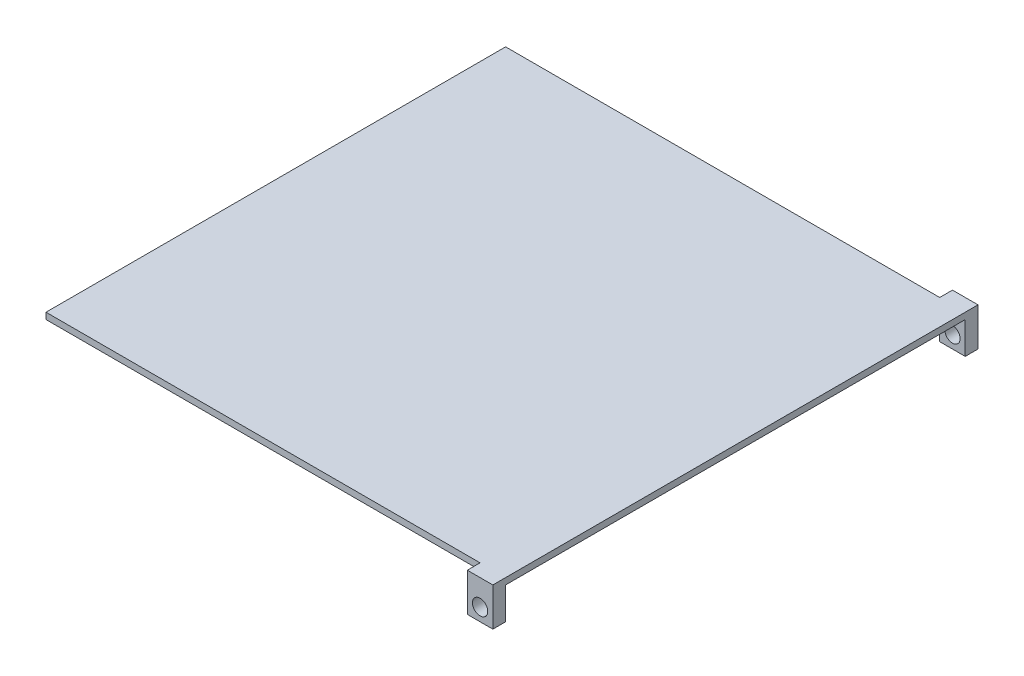
ISO-10303-21;
HEADER;
FILE_DESCRIPTION(('STEP AP214'),'2;1');
FILE_NAME('part.step','',(''),(''),'','','');
FILE_SCHEMA(('AUTOMOTIVE_DESIGN { 1 0 10303 214 1 1 1 1 }'));
ENDSEC;
DATA;
#1=APPLICATION_CONTEXT('core data for automotive mechanical design processes');
#2=APPLICATION_PROTOCOL_DEFINITION('international standard','automotive_design',2000,#1);
#3=PRODUCT_CONTEXT('',#1,'mechanical');
#4=PRODUCT('Part','Part','',(#3));
#5=PRODUCT_RELATED_PRODUCT_CATEGORY('part','',(#4));
#6=PRODUCT_DEFINITION_FORMATION('','',#4);
#7=PRODUCT_DEFINITION_CONTEXT('part definition',#1,'design');
#8=PRODUCT_DEFINITION('design','',#6,#7);
#9=PRODUCT_DEFINITION_SHAPE('','',#8);
#10=(LENGTH_UNIT() NAMED_UNIT(*) SI_UNIT(.MILLI.,.METRE.));
#11=(NAMED_UNIT(*) PLANE_ANGLE_UNIT() SI_UNIT($,.RADIAN.));
#12=(NAMED_UNIT(*) SI_UNIT($,.STERADIAN.) SOLID_ANGLE_UNIT());
#13=UNCERTAINTY_MEASURE_WITH_UNIT(LENGTH_MEASURE(1.E-05),#10,'distance_accuracy_value','');
#14=(GEOMETRIC_REPRESENTATION_CONTEXT(3) GLOBAL_UNCERTAINTY_ASSIGNED_CONTEXT((#13)) GLOBAL_UNIT_ASSIGNED_CONTEXT((#10,
#11,#12)) REPRESENTATION_CONTEXT('',''));
#15=CARTESIAN_POINT('',(0.,0.,0.));
#16=DIRECTION('',(0.,0.,1.));
#17=DIRECTION('',(1.,0.,0.));
#18=AXIS2_PLACEMENT_3D('',#15,#16,#17);
#19=CARTESIAN_POINT('',(0.,6.35,-457.2));
#20=DIRECTION('',(0.,0.,-1.));
#21=DIRECTION('',(-1.,0.,0.));
#22=AXIS2_PLACEMENT_3D('',#19,#20,#21);
#23=PLANE('',#22);
#24=DIRECTION('',(1.,0.,0.));
#25=VECTOR('',#24,1.);
#26=CARTESIAN_POINT('',(0.,6.35,-457.2));
#27=LINE('',#26,#25);
#28=CARTESIAN_POINT('',(0.,6.35,-457.2));
#29=VERTEX_POINT('',#28);
#30=CARTESIAN_POINT('',(431.8,6.35,-457.2));
#31=VERTEX_POINT('',#30);
#32=EDGE_CURVE('E157',#29,#31,#27,.T.);
#33=ORIENTED_EDGE('',*,*,#32,.T.);
#34=DIRECTION('',(0.,-1.,0.));
#35=VECTOR('',#34,1.);
#36=CARTESIAN_POINT('',(431.8,6.35,-457.2));
#37=LINE('',#36,#35);
#38=CARTESIAN_POINT('',(431.8,0.,-457.2));
#39=VERTEX_POINT('',#38);
#40=EDGE_CURVE('E139',#31,#39,#37,.T.);
#41=ORIENTED_EDGE('',*,*,#40,.T.);
#42=DIRECTION('',(1.,0.,0.));
#43=VECTOR('',#42,1.);
#44=CARTESIAN_POINT('',(0.,0.,-457.2));
#45=LINE('',#44,#43);
#46=CARTESIAN_POINT('',(0.,0.,-457.2));
#47=VERTEX_POINT('',#46);
#48=EDGE_CURVE('E161',#47,#39,#45,.T.);
#49=ORIENTED_EDGE('',*,*,#48,.F.);
#50=DIRECTION('',(0.,-1.,0.));
#51=VECTOR('',#50,1.);
#52=CARTESIAN_POINT('',(0.,6.35,-457.2));
#53=LINE('',#52,#51);
#54=EDGE_CURVE('E160',#29,#47,#53,.T.);
#55=ORIENTED_EDGE('',*,*,#54,.F.);
#56=EDGE_LOOP('',(#33,#41,#49,#55));
#57=FACE_BOUND('',#56,.T.);
#58=ADVANCED_FACE('F33',(#57),#23,.T.);
#59=CARTESIAN_POINT('',(0.,6.35,0.));
#60=DIRECTION('',(0.,0.,-1.));
#61=DIRECTION('',(-1.,0.,0.));
#62=AXIS2_PLACEMENT_3D('',#59,#60,#61);
#63=PLANE('',#62);
#64=DIRECTION('',(0.,-1.,0.));
#65=VECTOR('',#64,1.);
#66=CARTESIAN_POINT('',(431.8,6.35,0.));
#67=LINE('',#66,#65);
#68=CARTESIAN_POINT('',(431.8,6.35,0.));
#69=VERTEX_POINT('',#68);
#70=CARTESIAN_POINT('',(431.8,0.,0.));
#71=VERTEX_POINT('',#70);
#72=EDGE_CURVE('E56',#69,#71,#67,.T.);
#73=ORIENTED_EDGE('',*,*,#72,.F.);
#74=DIRECTION('',(1.,0.,0.));
#75=VECTOR('',#74,1.);
#76=CARTESIAN_POINT('',(0.,6.35,0.));
#77=LINE('',#76,#75);
#78=CARTESIAN_POINT('',(0.,6.35,0.));
#79=VERTEX_POINT('',#78);
#80=EDGE_CURVE('E201',#79,#69,#77,.T.);
#81=ORIENTED_EDGE('',*,*,#80,.F.);
#82=DIRECTION('',(0.,-1.,0.));
#83=VECTOR('',#82,1.);
#84=CARTESIAN_POINT('',(0.,6.35,0.));
#85=LINE('',#84,#83);
#86=CARTESIAN_POINT('',(0.,0.,0.));
#87=VERTEX_POINT('',#86);
#88=EDGE_CURVE('E11',#79,#87,#85,.T.);
#89=ORIENTED_EDGE('',*,*,#88,.T.);
#90=DIRECTION('',(1.,0.,0.));
#91=VECTOR('',#90,1.);
#92=CARTESIAN_POINT('',(0.,0.,0.));
#93=LINE('',#92,#91);
#94=EDGE_CURVE('E208',#87,#71,#93,.T.);
#95=ORIENTED_EDGE('',*,*,#94,.T.);
#96=EDGE_LOOP('',(#73,#81,#89,#95));
#97=FACE_BOUND('',#96,.T.);
#98=ADVANCED_FACE('F230',(#97),#63,.F.);
#99=CARTESIAN_POINT('',(0.,6.35,0.));
#100=DIRECTION('',(1.,0.,0.));
#101=DIRECTION('',(0.,0.,-1.));
#102=AXIS2_PLACEMENT_3D('',#99,#100,#101);
#103=PLANE('',#102);
#104=DIRECTION('',(0.,0.,1.));
#105=VECTOR('',#104,1.);
#106=CARTESIAN_POINT('',(0.,0.,0.));
#107=LINE('',#106,#105);
#108=EDGE_CURVE('E197',#47,#87,#107,.T.);
#109=ORIENTED_EDGE('',*,*,#108,.T.);
#110=ORIENTED_EDGE('',*,*,#88,.F.);
#111=DIRECTION('',(0.,0.,1.));
#112=VECTOR('',#111,1.);
#113=CARTESIAN_POINT('',(0.,6.35,0.));
#114=LINE('',#113,#112);
#115=EDGE_CURVE('E198',#29,#79,#114,.T.);
#116=ORIENTED_EDGE('',*,*,#115,.F.);
#117=ORIENTED_EDGE('',*,*,#54,.T.);
#118=EDGE_LOOP('',(#109,#110,#116,#117));
#119=FACE_BOUND('',#118,.T.);
#120=ADVANCED_FACE('F35',(#119),#103,.F.);
#121=CARTESIAN_POINT('',(457.2,6.35,0.));
#122=DIRECTION('',(-1.,0.,0.));
#123=DIRECTION('',(0.,0.,1.));
#124=AXIS2_PLACEMENT_3D('',#121,#122,#123);
#125=PLANE('',#124);
#126=DIRECTION('',(0.,0.,-1.));
#127=VECTOR('',#126,1.);
#128=CARTESIAN_POINT('',(457.2,0.,0.));
#129=LINE('',#128,#127);
#130=CARTESIAN_POINT('',(457.2,0.,0.));
#131=VERTEX_POINT('',#130);
#132=CARTESIAN_POINT('',(457.2,0.,-457.2));
#133=VERTEX_POINT('',#132);
#134=EDGE_CURVE('E202',#131,#133,#129,.T.);
#135=ORIENTED_EDGE('',*,*,#134,.T.);
#136=DIRECTION('',(0.,1.,0.));
#137=VECTOR('',#136,1.);
#138=CARTESIAN_POINT('',(457.2,6.35,-457.2));
#139=LINE('',#138,#137);
#140=CARTESIAN_POINT('',(457.2,-31.75,-457.2));
#141=VERTEX_POINT('',#140);
#142=EDGE_CURVE('E123',#141,#133,#139,.T.);
#143=ORIENTED_EDGE('',*,*,#142,.F.);
#144=DIRECTION('',(0.,0.,1.));
#145=VECTOR('',#144,1.);
#146=CARTESIAN_POINT('',(457.2,-31.75,-469.9));
#147=LINE('',#146,#145);
#148=CARTESIAN_POINT('',(457.2,-31.75,-469.9));
#149=VERTEX_POINT('',#148);
#150=EDGE_CURVE('E117',#149,#141,#147,.T.);
#151=ORIENTED_EDGE('',*,*,#150,.F.);
#152=DIRECTION('',(0.,1.,0.));
#153=VECTOR('',#152,1.);
#154=CARTESIAN_POINT('',(457.2,6.35,-469.9));
#155=LINE('',#154,#153);
#156=CARTESIAN_POINT('',(457.2,6.35,-469.9));
#157=VERTEX_POINT('',#156);
#158=EDGE_CURVE('E121',#149,#157,#155,.T.);
#159=ORIENTED_EDGE('',*,*,#158,.T.);
#160=DIRECTION('',(0.,0.,-1.));
#161=VECTOR('',#160,1.);
#162=CARTESIAN_POINT('',(457.2,6.35,0.));
#163=LINE('',#162,#161);
#164=CARTESIAN_POINT('',(457.2,6.35,12.7));
#165=VERTEX_POINT('',#164);
#166=EDGE_CURVE('E41',#165,#157,#163,.T.);
#167=ORIENTED_EDGE('',*,*,#166,.F.);
#168=DIRECTION('',(0.,1.,0.));
#169=VECTOR('',#168,1.);
#170=CARTESIAN_POINT('',(457.2,6.35,12.7));
#171=LINE('',#170,#169);
#172=CARTESIAN_POINT('',(457.2,-31.75,12.7));
#173=VERTEX_POINT('',#172);
#174=EDGE_CURVE('E173',#173,#165,#171,.T.);
#175=ORIENTED_EDGE('',*,*,#174,.F.);
#176=DIRECTION('',(0.,0.,-1.));
#177=VECTOR('',#176,1.);
#178=CARTESIAN_POINT('',(457.2,-31.75,12.7));
#179=LINE('',#178,#177);
#180=CARTESIAN_POINT('',(457.2,-31.75,0.));
#181=VERTEX_POINT('',#180);
#182=EDGE_CURVE('E183',#173,#181,#179,.T.);
#183=ORIENTED_EDGE('',*,*,#182,.T.);
#184=DIRECTION('',(0.,1.,0.));
#185=VECTOR('',#184,1.);
#186=CARTESIAN_POINT('',(457.2,6.35,0.));
#187=LINE('',#186,#185);
#188=EDGE_CURVE('E170',#181,#131,#187,.T.);
#189=ORIENTED_EDGE('',*,*,#188,.T.);
#190=EDGE_LOOP('',(#135,#143,#151,#159,#167,#175,#183,#189));
#191=FACE_BOUND('',#190,.T.);
#192=ADVANCED_FACE('F120',(#191),#125,.F.);
#193=CARTESIAN_POINT('',(0.,6.35,0.));
#194=DIRECTION('',(0.,-1.,0.));
#195=DIRECTION('',(0.,0.,-1.));
#196=AXIS2_PLACEMENT_3D('',#193,#194,#195);
#197=PLANE('',#196);
#198=ORIENTED_EDGE('',*,*,#115,.T.);
#199=ORIENTED_EDGE('',*,*,#80,.T.);
#200=DIRECTION('',(0.,0.,-1.));
#201=VECTOR('',#200,1.);
#202=CARTESIAN_POINT('',(431.8,6.35,12.7));
#203=LINE('',#202,#201);
#204=CARTESIAN_POINT('',(431.8,6.35,12.7));
#205=VERTEX_POINT('',#204);
#206=EDGE_CURVE('E194',#205,#69,#203,.T.);
#207=ORIENTED_EDGE('',*,*,#206,.F.);
#208=DIRECTION('',(-1.,0.,0.));
#209=VECTOR('',#208,1.);
#210=CARTESIAN_POINT('',(457.2,6.35,12.7));
#211=LINE('',#210,#209);
#212=EDGE_CURVE('E176',#165,#205,#211,.T.);
#213=ORIENTED_EDGE('',*,*,#212,.F.);
#214=ORIENTED_EDGE('',*,*,#166,.T.);
#215=DIRECTION('',(-1.,0.,0.));
#216=VECTOR('',#215,1.);
#217=CARTESIAN_POINT('',(457.2,6.35,-469.9));
#218=LINE('',#217,#216);
#219=CARTESIAN_POINT('',(431.8,6.35,-469.9));
#220=VERTEX_POINT('',#219);
#221=EDGE_CURVE('E138',#157,#220,#218,.T.);
#222=ORIENTED_EDGE('',*,*,#221,.T.);
#223=DIRECTION('',(0.,0.,1.));
#224=VECTOR('',#223,1.);
#225=CARTESIAN_POINT('',(431.8,6.35,-469.9));
#226=LINE('',#225,#224);
#227=EDGE_CURVE('E148',#220,#31,#226,.T.);
#228=ORIENTED_EDGE('',*,*,#227,.T.);
#229=ORIENTED_EDGE('',*,*,#32,.F.);
#230=EDGE_LOOP('',(#198,#199,#207,#213,#214,#222,#228,#229));
#231=FACE_BOUND('',#230,.T.);
#232=ADVANCED_FACE('F227',(#231),#197,.F.);
#233=CARTESIAN_POINT('',(0.,0.,0.));
#234=DIRECTION('',(0.,-1.,0.));
#235=DIRECTION('',(0.,0.,-1.));
#236=AXIS2_PLACEMENT_3D('',#233,#234,#235);
#237=PLANE('',#236);
#238=CARTESIAN_POINT('',(228.6,0.,-228.6));
#239=DIRECTION('',(0.,-1.,0.));
#240=DIRECTION('',(0.,0.,-1.));
#241=AXIS2_PLACEMENT_3D('',#238,#239,#240);
#242=CIRCLE('',#241,3.175);
#243=CARTESIAN_POINT('',(228.6,0.,-231.775));
#244=VERTEX_POINT('',#243);
#245=EDGE_CURVE('E394',#244,#244,#242,.T.);
#246=ORIENTED_EDGE('',*,*,#245,.F.);
#247=EDGE_LOOP('',(#246));
#248=FACE_BOUND('',#247,.T.);
#249=ORIENTED_EDGE('',*,*,#108,.F.);
#250=ORIENTED_EDGE('',*,*,#48,.T.);
#251=EDGE_CURVE('E128',#39,#133,#45,.T.);
#252=ORIENTED_EDGE('',*,*,#251,.T.);
#253=ORIENTED_EDGE('',*,*,#134,.F.);
#254=EDGE_CURVE('E207',#71,#131,#93,.T.);
#255=ORIENTED_EDGE('',*,*,#254,.F.);
#256=ORIENTED_EDGE('',*,*,#94,.F.);
#257=EDGE_LOOP('',(#249,#250,#252,#253,#255,#256));
#258=FACE_BOUND('',#257,.T.);
#259=ADVANCED_FACE('F214',(#248,#258),#237,.T.);
#260=CARTESIAN_POINT('',(0.,0.,12.7));
#261=DIRECTION('',(0.,0.,-1.));
#262=DIRECTION('',(-1.,0.,0.));
#263=AXIS2_PLACEMENT_3D('',#260,#261,#262);
#264=PLANE('',#263);
#265=ORIENTED_EDGE('',*,*,#174,.T.);
#266=ORIENTED_EDGE('',*,*,#212,.T.);
#267=DIRECTION('',(0.,-1.,0.));
#268=VECTOR('',#267,1.);
#269=CARTESIAN_POINT('',(431.8,6.35,12.7));
#270=LINE('',#269,#268);
#271=CARTESIAN_POINT('',(431.8,-31.75,12.7));
#272=VERTEX_POINT('',#271);
#273=EDGE_CURVE('E179',#205,#272,#270,.T.);
#274=ORIENTED_EDGE('',*,*,#273,.T.);
#275=DIRECTION('',(1.,0.,0.));
#276=VECTOR('',#275,1.);
#277=CARTESIAN_POINT('',(457.2,-31.75,12.7));
#278=LINE('',#277,#276);
#279=EDGE_CURVE('E181',#272,#173,#278,.T.);
#280=ORIENTED_EDGE('',*,*,#279,.T.);
#281=EDGE_LOOP('',(#265,#266,#274,#280));
#282=FACE_BOUND('',#281,.T.);
#283=CARTESIAN_POINT('',(444.5,-19.05,12.7));
#284=DIRECTION('',(0.,0.,1.));
#285=DIRECTION('',(1.,0.,0.));
#286=AXIS2_PLACEMENT_3D('',#283,#284,#285);
#287=CIRCLE('',#286,7.62000000000003);
#288=CARTESIAN_POINT('',(452.12,-19.05,12.7));
#289=VERTEX_POINT('',#288);
#290=EDGE_CURVE('E167',#289,#289,#287,.T.);
#291=ORIENTED_EDGE('',*,*,#290,.F.);
#292=EDGE_LOOP('',(#291));
#293=FACE_BOUND('',#292,.T.);
#294=ADVANCED_FACE('F239',(#282,#293),#264,.F.);
#295=CARTESIAN_POINT('',(0.,0.,0.));
#296=DIRECTION('',(0.,0.,-1.));
#297=DIRECTION('',(-1.,0.,0.));
#298=AXIS2_PLACEMENT_3D('',#295,#296,#297);
#299=PLANE('',#298);
#300=CARTESIAN_POINT('',(431.8,-31.75,0.));
#301=VERTEX_POINT('',#300);
#302=EDGE_CURVE('E186',#71,#301,#67,.T.);
#303=ORIENTED_EDGE('',*,*,#302,.F.);
#304=ORIENTED_EDGE('',*,*,#254,.T.);
#305=ORIENTED_EDGE('',*,*,#188,.F.);
#306=DIRECTION('',(1.,0.,0.));
#307=VECTOR('',#306,1.);
#308=CARTESIAN_POINT('',(457.2,-31.75,0.));
#309=LINE('',#308,#307);
#310=EDGE_CURVE('E177',#301,#181,#309,.T.);
#311=ORIENTED_EDGE('',*,*,#310,.F.);
#312=EDGE_LOOP('',(#303,#304,#305,#311));
#313=FACE_BOUND('',#312,.T.);
#314=CARTESIAN_POINT('',(444.5,-19.05,0.));
#315=DIRECTION('',(0.,0.,1.));
#316=DIRECTION('',(1.,0.,0.));
#317=AXIS2_PLACEMENT_3D('',#314,#315,#316);
#318=CIRCLE('',#317,7.62000000000003);
#319=CARTESIAN_POINT('',(452.12,-19.05,0.));
#320=VERTEX_POINT('',#319);
#321=EDGE_CURVE('E166',#320,#320,#318,.T.);
#322=ORIENTED_EDGE('',*,*,#321,.T.);
#323=EDGE_LOOP('',(#322));
#324=FACE_BOUND('',#323,.T.);
#325=ADVANCED_FACE('F217',(#313,#324),#299,.T.);
#326=CARTESIAN_POINT('',(431.8,6.35,12.7));
#327=DIRECTION('',(1.,0.,0.));
#328=DIRECTION('',(0.,0.,-1.));
#329=AXIS2_PLACEMENT_3D('',#326,#327,#328);
#330=PLANE('',#329);
#331=ORIENTED_EDGE('',*,*,#72,.T.);
#332=ORIENTED_EDGE('',*,*,#302,.T.);
#333=DIRECTION('',(0.,0.,-1.));
#334=VECTOR('',#333,1.);
#335=CARTESIAN_POINT('',(431.8,-31.75,12.7));
#336=LINE('',#335,#334);
#337=EDGE_CURVE('E191',#272,#301,#336,.T.);
#338=ORIENTED_EDGE('',*,*,#337,.F.);
#339=ORIENTED_EDGE('',*,*,#273,.F.);
#340=ORIENTED_EDGE('',*,*,#206,.T.);
#341=EDGE_LOOP('',(#331,#332,#338,#339,#340));
#342=FACE_BOUND('',#341,.T.);
#343=ADVANCED_FACE('F222',(#342),#330,.F.);
#344=CARTESIAN_POINT('',(457.2,-31.75,12.7));
#345=DIRECTION('',(0.,1.,0.));
#346=DIRECTION('',(0.,0.,1.));
#347=AXIS2_PLACEMENT_3D('',#344,#345,#346);
#348=PLANE('',#347);
#349=ORIENTED_EDGE('',*,*,#310,.T.);
#350=ORIENTED_EDGE('',*,*,#182,.F.);
#351=ORIENTED_EDGE('',*,*,#279,.F.);
#352=ORIENTED_EDGE('',*,*,#337,.T.);
#353=EDGE_LOOP('',(#349,#350,#351,#352));
#354=FACE_BOUND('',#353,.T.);
#355=ADVANCED_FACE('F243',(#354),#348,.F.);
#356=CARTESIAN_POINT('',(444.5,-19.05,12.7));
#357=DIRECTION('',(0.,0.,-1.));
#358=DIRECTION('',(-1.,0.,0.));
#359=AXIS2_PLACEMENT_3D('',#356,#357,#358);
#360=CYLINDRICAL_SURFACE('',#359,7.62000000000003);
#361=ORIENTED_EDGE('',*,*,#290,.T.);
#362=EDGE_LOOP('',(#361));
#363=FACE_BOUND('',#362,.T.);
#364=ORIENTED_EDGE('',*,*,#321,.F.);
#365=EDGE_LOOP('',(#364));
#366=FACE_BOUND('',#365,.T.);
#367=ADVANCED_FACE('F245',(#363,#366),#360,.F.);
#368=CARTESIAN_POINT('',(0.,0.,-457.2));
#369=DIRECTION('',(0.,0.,1.));
#370=DIRECTION('',(-1.,0.,0.));
#371=AXIS2_PLACEMENT_3D('',#368,#369,#370);
#372=PLANE('',#371);
#373=CARTESIAN_POINT('',(444.5,-19.05,-457.2));
#374=DIRECTION('',(0.,0.,1.));
#375=DIRECTION('',(1.,0.,0.));
#376=AXIS2_PLACEMENT_3D('',#373,#374,#375);
#377=CIRCLE('',#376,7.62000000000003);
#378=CARTESIAN_POINT('',(452.12,-19.05,-457.2));
#379=VERTEX_POINT('',#378);
#380=EDGE_CURVE('E393',#379,#379,#377,.T.);
#381=ORIENTED_EDGE('',*,*,#380,.F.);
#382=EDGE_LOOP('',(#381));
#383=FACE_BOUND('',#382,.T.);
#384=ORIENTED_EDGE('',*,*,#251,.F.);
#385=CARTESIAN_POINT('',(431.8,-31.75,-457.2));
#386=VERTEX_POINT('',#385);
#387=EDGE_CURVE('E48',#39,#386,#37,.T.);
#388=ORIENTED_EDGE('',*,*,#387,.T.);
#389=DIRECTION('',(1.,0.,0.));
#390=VECTOR('',#389,1.);
#391=CARTESIAN_POINT('',(457.2,-31.75,-457.2));
#392=LINE('',#391,#390);
#393=EDGE_CURVE('E150',#386,#141,#392,.T.);
#394=ORIENTED_EDGE('',*,*,#393,.T.);
#395=ORIENTED_EDGE('',*,*,#142,.T.);
#396=EDGE_LOOP('',(#384,#388,#394,#395));
#397=FACE_BOUND('',#396,.T.);
#398=ADVANCED_FACE('F251',(#383,#397),#372,.T.);
#399=CARTESIAN_POINT('',(457.2,-31.75,-469.9));
#400=DIRECTION('',(0.,-1.,0.));
#401=DIRECTION('',(0.,0.,-1.));
#402=AXIS2_PLACEMENT_3D('',#399,#400,#401);
#403=PLANE('',#402);
#404=ORIENTED_EDGE('',*,*,#393,.F.);
#405=DIRECTION('',(0.,0.,1.));
#406=VECTOR('',#405,1.);
#407=CARTESIAN_POINT('',(431.8,-31.75,-469.9));
#408=LINE('',#407,#406);
#409=CARTESIAN_POINT('',(431.8,-31.75,-469.9));
#410=VERTEX_POINT('',#409);
#411=EDGE_CURVE('E129',#410,#386,#408,.T.);
#412=ORIENTED_EDGE('',*,*,#411,.F.);
#413=DIRECTION('',(1.,0.,0.));
#414=VECTOR('',#413,1.);
#415=CARTESIAN_POINT('',(457.2,-31.75,-469.9));
#416=LINE('',#415,#414);
#417=EDGE_CURVE('E135',#410,#149,#416,.T.);
#418=ORIENTED_EDGE('',*,*,#417,.T.);
#419=ORIENTED_EDGE('',*,*,#150,.T.);
#420=EDGE_LOOP('',(#404,#412,#418,#419));
#421=FACE_BOUND('',#420,.T.);
#422=ADVANCED_FACE('F141',(#421),#403,.T.);
#423=CARTESIAN_POINT('',(431.8,6.35,-469.9));
#424=DIRECTION('',(-1.,0.,0.));
#425=DIRECTION('',(0.,0.,1.));
#426=AXIS2_PLACEMENT_3D('',#423,#424,#425);
#427=PLANE('',#426);
#428=ORIENTED_EDGE('',*,*,#40,.F.);
#429=ORIENTED_EDGE('',*,*,#227,.F.);
#430=DIRECTION('',(0.,-1.,0.));
#431=VECTOR('',#430,1.);
#432=CARTESIAN_POINT('',(431.8,6.35,-469.9));
#433=LINE('',#432,#431);
#434=EDGE_CURVE('E142',#220,#410,#433,.T.);
#435=ORIENTED_EDGE('',*,*,#434,.T.);
#436=ORIENTED_EDGE('',*,*,#411,.T.);
#437=ORIENTED_EDGE('',*,*,#387,.F.);
#438=EDGE_LOOP('',(#428,#429,#435,#436,#437));
#439=FACE_BOUND('',#438,.T.);
#440=ADVANCED_FACE('F235',(#439),#427,.T.);
#441=CARTESIAN_POINT('',(0.,0.,-469.9));
#442=DIRECTION('',(0.,0.,1.));
#443=DIRECTION('',(-1.,0.,0.));
#444=AXIS2_PLACEMENT_3D('',#441,#442,#443);
#445=PLANE('',#444);
#446=CARTESIAN_POINT('',(444.5,-19.05,-469.9));
#447=DIRECTION('',(0.,0.,1.));
#448=DIRECTION('',(1.,0.,0.));
#449=AXIS2_PLACEMENT_3D('',#446,#447,#448);
#450=CIRCLE('',#449,7.62000000000003);
#451=CARTESIAN_POINT('',(452.12,-19.05,-469.9));
#452=VERTEX_POINT('',#451);
#453=EDGE_CURVE('E151',#452,#452,#450,.T.);
#454=ORIENTED_EDGE('',*,*,#453,.T.);
#455=EDGE_LOOP('',(#454));
#456=FACE_BOUND('',#455,.T.);
#457=ORIENTED_EDGE('',*,*,#158,.F.);
#458=ORIENTED_EDGE('',*,*,#417,.F.);
#459=ORIENTED_EDGE('',*,*,#434,.F.);
#460=ORIENTED_EDGE('',*,*,#221,.F.);
#461=EDGE_LOOP('',(#457,#458,#459,#460));
#462=FACE_BOUND('',#461,.T.);
#463=ADVANCED_FACE('F133',(#456,#462),#445,.F.);
#464=CARTESIAN_POINT('',(444.5,-19.05,-469.9));
#465=DIRECTION('',(0.,0.,1.));
#466=DIRECTION('',(1.,0.,0.));
#467=AXIS2_PLACEMENT_3D('',#464,#465,#466);
#468=CYLINDRICAL_SURFACE('',#467,7.62000000000003);
#469=ORIENTED_EDGE('',*,*,#453,.F.);
#470=EDGE_LOOP('',(#469));
#471=FACE_BOUND('',#470,.T.);
#472=ORIENTED_EDGE('',*,*,#380,.T.);
#473=EDGE_LOOP('',(#472));
#474=FACE_BOUND('',#473,.T.);
#475=ADVANCED_FACE('F348',(#471,#474),#468,.F.);
#476=CARTESIAN_POINT('',(228.6,-7.62,-228.6));
#477=DIRECTION('',(0.,1.,0.));
#478=DIRECTION('',(0.,0.,1.));
#479=AXIS2_PLACEMENT_3D('',#476,#477,#478);
#480=CYLINDRICAL_SURFACE('',#479,3.175);
#481=CARTESIAN_POINT('',(228.6,-7.62,-228.6));
#482=DIRECTION('',(0.,-1.,0.));
#483=DIRECTION('',(0.,0.,-1.));
#484=AXIS2_PLACEMENT_3D('',#481,#482,#483);
#485=CIRCLE('',#484,3.175);
#486=CARTESIAN_POINT('',(228.6,-7.62,-231.775));
#487=VERTEX_POINT('',#486);
#488=EDGE_CURVE('E392',#487,#487,#485,.T.);
#489=ORIENTED_EDGE('',*,*,#488,.F.);
#490=EDGE_LOOP('',(#489));
#491=FACE_BOUND('',#490,.T.);
#492=ORIENTED_EDGE('',*,*,#245,.T.);
#493=EDGE_LOOP('',(#492));
#494=FACE_BOUND('',#493,.T.);
#495=ADVANCED_FACE('F358',(#491,#494),#480,.T.);
#496=CARTESIAN_POINT('',(228.6,-7.62,-228.6));
#497=DIRECTION('',(0.,-1.,0.));
#498=DIRECTION('',(0.,0.,-1.));
#499=AXIS2_PLACEMENT_3D('',#496,#497,#498);
#500=PLANE('',#499);
#501=ORIENTED_EDGE('',*,*,#488,.T.);
#502=EDGE_LOOP('',(#501));
#503=FACE_BOUND('',#502,.T.);
#504=ADVANCED_FACE('F376',(#503),#500,.T.);
#505=CLOSED_SHELL('',(#58,#98,#120,#192,#232,#259,#294,#325,#343,#355,#367,#398,#422,#440,#463,
#475,#495,#504));
#506=MANIFOLD_SOLID_BREP('B2',#505);
#507=ADVANCED_BREP_SHAPE_REPRESENTATION('',(#18,#506),#14);
#508=SHAPE_DEFINITION_REPRESENTATION(#9,#507);
ENDSEC;
END-ISO-10303-21;
